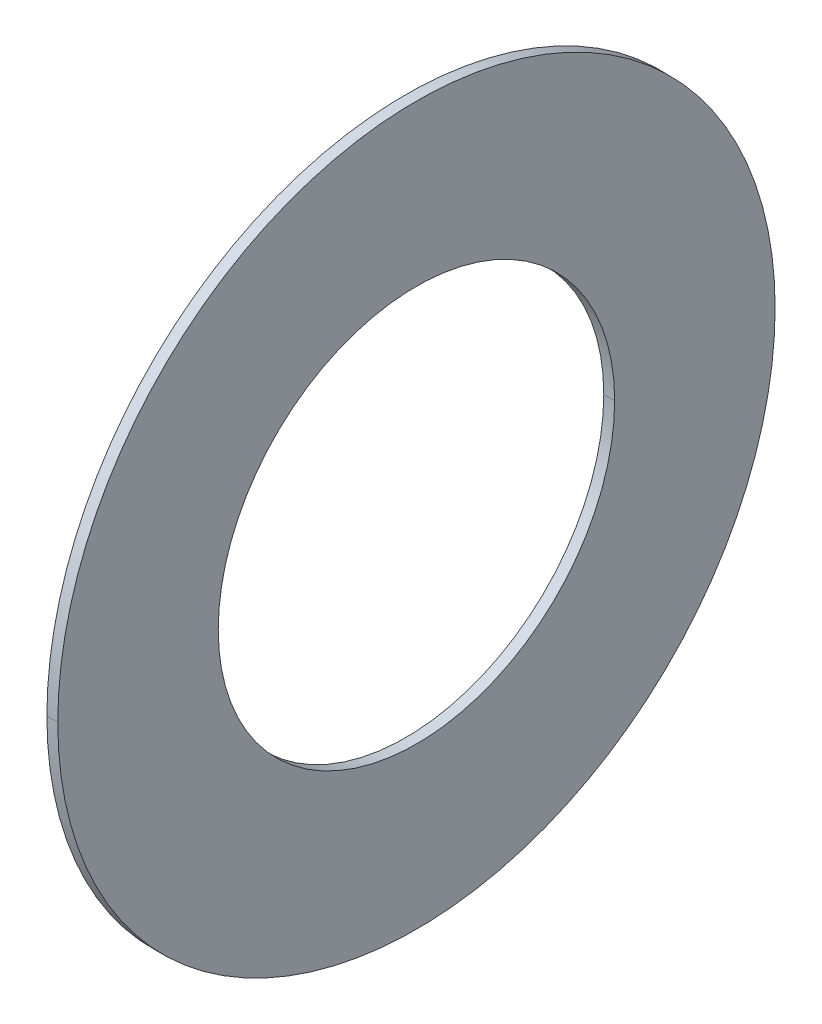
ISO-10303-21;
HEADER;
FILE_DESCRIPTION(('STEP AP214'),'2;1');
FILE_NAME('part.step','',(''),(''),'','','');
FILE_SCHEMA(('AUTOMOTIVE_DESIGN { 1 0 10303 214 1 1 1 1 }'));
ENDSEC;
DATA;
#1=APPLICATION_CONTEXT('core data for automotive mechanical design processes');
#2=APPLICATION_PROTOCOL_DEFINITION('international standard','automotive_design',2000,#1);
#3=PRODUCT_CONTEXT('',#1,'mechanical');
#4=PRODUCT('Part','Part','',(#3));
#5=PRODUCT_RELATED_PRODUCT_CATEGORY('part','',(#4));
#6=PRODUCT_DEFINITION_FORMATION('','',#4);
#7=PRODUCT_DEFINITION_CONTEXT('part definition',#1,'design');
#8=PRODUCT_DEFINITION('design','',#6,#7);
#9=PRODUCT_DEFINITION_SHAPE('','',#8);
#10=(LENGTH_UNIT() NAMED_UNIT(*) SI_UNIT(.MILLI.,.METRE.));
#11=(NAMED_UNIT(*) PLANE_ANGLE_UNIT() SI_UNIT($,.RADIAN.));
#12=(NAMED_UNIT(*) SI_UNIT($,.STERADIAN.) SOLID_ANGLE_UNIT());
#13=UNCERTAINTY_MEASURE_WITH_UNIT(LENGTH_MEASURE(1.E-05),#10,'distance_accuracy_value','');
#14=(GEOMETRIC_REPRESENTATION_CONTEXT(3) GLOBAL_UNCERTAINTY_ASSIGNED_CONTEXT((#13)) GLOBAL_UNIT_ASSIGNED_CONTEXT((#10,
#11,#12)) REPRESENTATION_CONTEXT('',''));
#15=CARTESIAN_POINT('',(0.,0.,0.));
#16=DIRECTION('',(0.,0.,1.));
#17=DIRECTION('',(1.,0.,0.));
#18=AXIS2_PLACEMENT_3D('',#15,#16,#17);
#19=CARTESIAN_POINT('',(6.615,9.5,0.));
#20=DIRECTION('',(-1.,0.,0.));
#21=DIRECTION('',(0.,0.,1.));
#22=AXIS2_PLACEMENT_3D('',#19,#20,#21);
#23=PLANE('',#22);
#24=CARTESIAN_POINT('',(6.615,0.,0.));
#25=DIRECTION('',(1.,0.,0.));
#26=DIRECTION('',(0.,0.,-1.));
#27=AXIS2_PLACEMENT_3D('',#24,#25,#26);
#28=CIRCLE('',#27,5.25);
#29=CARTESIAN_POINT('',(6.615,0.,-5.25));
#30=VERTEX_POINT('',#29);
#31=CARTESIAN_POINT('',(6.615,0.,5.25));
#32=VERTEX_POINT('',#31);
#33=EDGE_CURVE('E11',#30,#32,#28,.T.);
#34=ORIENTED_EDGE('',*,*,#33,.T.);
#35=CARTESIAN_POINT('',(6.615,0.,0.));
#36=DIRECTION('',(1.,0.,0.));
#37=DIRECTION('',(0.,0.,-1.));
#38=AXIS2_PLACEMENT_3D('',#35,#36,#37);
#39=CIRCLE('',#38,5.25);
#40=EDGE_CURVE('E25',#32,#30,#39,.T.);
#41=ORIENTED_EDGE('',*,*,#40,.T.);
#42=EDGE_LOOP('',(#34,#41));
#43=FACE_BOUND('',#42,.T.);
#44=CARTESIAN_POINT('',(6.615,0.,0.));
#45=DIRECTION('',(1.,0.,0.));
#46=DIRECTION('',(0.,0.,-1.));
#47=AXIS2_PLACEMENT_3D('',#44,#45,#46);
#48=CIRCLE('',#47,9.5);
#49=CARTESIAN_POINT('',(6.615,0.,9.5));
#50=VERTEX_POINT('',#49);
#51=CARTESIAN_POINT('',(6.615,0.,-9.5));
#52=VERTEX_POINT('',#51);
#53=EDGE_CURVE('E95',#50,#52,#48,.T.);
#54=ORIENTED_EDGE('',*,*,#53,.F.);
#55=CARTESIAN_POINT('',(6.615,0.,0.));
#56=DIRECTION('',(1.,0.,0.));
#57=DIRECTION('',(0.,0.,-1.));
#58=AXIS2_PLACEMENT_3D('',#55,#56,#57);
#59=CIRCLE('',#58,9.5);
#60=EDGE_CURVE('E90',#52,#50,#59,.T.);
#61=ORIENTED_EDGE('',*,*,#60,.F.);
#62=EDGE_LOOP('',(#54,#61));
#63=FACE_BOUND('',#62,.T.);
#64=ADVANCED_FACE('F17',(#43,#63),#23,.T.);
#65=CARTESIAN_POINT('',(6.90375,0.,0.));
#66=DIRECTION('',(1.,0.,0.));
#67=DIRECTION('',(0.,-1.,0.));
#68=AXIS2_PLACEMENT_3D('',#65,#66,#67);
#69=CYLINDRICAL_SURFACE('',#68,9.5);
#70=DIRECTION('',(1.,0.,0.));
#71=VECTOR('',#70,1.);
#72=CARTESIAN_POINT('',(6.615,0.,9.5));
#73=LINE('',#72,#71);
#74=CARTESIAN_POINT('',(6.90375,0.,9.5));
#75=VERTEX_POINT('',#74);
#76=EDGE_CURVE('E86',#50,#75,#73,.T.);
#77=ORIENTED_EDGE('',*,*,#76,.T.);
#78=CARTESIAN_POINT('',(6.90375,0.,0.));
#79=DIRECTION('',(1.,0.,0.));
#80=DIRECTION('',(0.,0.,-1.));
#81=AXIS2_PLACEMENT_3D('',#78,#79,#80);
#82=CIRCLE('',#81,9.5);
#83=CARTESIAN_POINT('',(6.90375,0.,-9.5));
#84=VERTEX_POINT('',#83);
#85=EDGE_CURVE('E81',#84,#75,#82,.T.);
#86=ORIENTED_EDGE('',*,*,#85,.F.);
#87=DIRECTION('',(1.,0.,0.));
#88=VECTOR('',#87,1.);
#89=CARTESIAN_POINT('',(6.615,0.,-9.5));
#90=LINE('',#89,#88);
#91=EDGE_CURVE('E70',#52,#84,#90,.T.);
#92=ORIENTED_EDGE('',*,*,#91,.F.);
#93=ORIENTED_EDGE('',*,*,#60,.T.);
#94=EDGE_LOOP('',(#77,#86,#92,#93));
#95=FACE_BOUND('',#94,.T.);
#96=ADVANCED_FACE('F111',(#95),#69,.T.);
#97=CARTESIAN_POINT('',(6.90375,0.,0.));
#98=DIRECTION('',(1.,0.,0.));
#99=DIRECTION('',(0.,1.,0.));
#100=AXIS2_PLACEMENT_3D('',#97,#98,#99);
#101=CYLINDRICAL_SURFACE('',#100,9.5);
#102=ORIENTED_EDGE('',*,*,#76,.F.);
#103=ORIENTED_EDGE('',*,*,#53,.T.);
#104=ORIENTED_EDGE('',*,*,#91,.T.);
#105=CARTESIAN_POINT('',(6.90375,0.,0.));
#106=DIRECTION('',(1.,0.,0.));
#107=DIRECTION('',(0.,0.,-1.));
#108=AXIS2_PLACEMENT_3D('',#105,#106,#107);
#109=CIRCLE('',#108,9.5);
#110=EDGE_CURVE('E67',#75,#84,#109,.T.);
#111=ORIENTED_EDGE('',*,*,#110,.F.);
#112=EDGE_LOOP('',(#102,#103,#104,#111));
#113=FACE_BOUND('',#112,.T.);
#114=ADVANCED_FACE('F106',(#113),#101,.T.);
#115=CARTESIAN_POINT('',(6.90375,5.25,0.));
#116=DIRECTION('',(1.,0.,0.));
#117=DIRECTION('',(0.,0.,-1.));
#118=AXIS2_PLACEMENT_3D('',#115,#116,#117);
#119=PLANE('',#118);
#120=ORIENTED_EDGE('',*,*,#85,.T.);
#121=ORIENTED_EDGE('',*,*,#110,.T.);
#122=EDGE_LOOP('',(#120,#121));
#123=FACE_BOUND('',#122,.T.);
#124=CARTESIAN_POINT('',(6.90375,0.,0.));
#125=DIRECTION('',(1.,0.,0.));
#126=DIRECTION('',(0.,0.,-1.));
#127=AXIS2_PLACEMENT_3D('',#124,#125,#126);
#128=CIRCLE('',#127,5.25);
#129=CARTESIAN_POINT('',(6.90375,0.,5.25));
#130=VERTEX_POINT('',#129);
#131=CARTESIAN_POINT('',(6.90375,0.,-5.25));
#132=VERTEX_POINT('',#131);
#133=EDGE_CURVE('E55',#130,#132,#128,.T.);
#134=ORIENTED_EDGE('',*,*,#133,.F.);
#135=CARTESIAN_POINT('',(6.90375,0.,0.));
#136=DIRECTION('',(1.,0.,0.));
#137=DIRECTION('',(0.,0.,-1.));
#138=AXIS2_PLACEMENT_3D('',#135,#136,#137);
#139=CIRCLE('',#138,5.25);
#140=EDGE_CURVE('E51',#132,#130,#139,.T.);
#141=ORIENTED_EDGE('',*,*,#140,.F.);
#142=EDGE_LOOP('',(#134,#141));
#143=FACE_BOUND('',#142,.T.);
#144=ADVANCED_FACE('F53',(#123,#143),#119,.T.);
#145=CARTESIAN_POINT('',(6.90375,0.,0.));
#146=DIRECTION('',(1.,0.,0.));
#147=DIRECTION('',(0.,-1.,0.));
#148=AXIS2_PLACEMENT_3D('',#145,#146,#147);
#149=CYLINDRICAL_SURFACE('',#148,5.25);
#150=DIRECTION('',(1.,0.,0.));
#151=VECTOR('',#150,1.);
#152=CARTESIAN_POINT('',(6.615,0.,5.25));
#153=LINE('',#152,#151);
#154=EDGE_CURVE('E59',#32,#130,#153,.T.);
#155=ORIENTED_EDGE('',*,*,#154,.F.);
#156=ORIENTED_EDGE('',*,*,#33,.F.);
#157=DIRECTION('',(1.,0.,0.));
#158=VECTOR('',#157,1.);
#159=CARTESIAN_POINT('',(6.615,0.,-5.25));
#160=LINE('',#159,#158);
#161=EDGE_CURVE('E62',#30,#132,#160,.T.);
#162=ORIENTED_EDGE('',*,*,#161,.T.);
#163=ORIENTED_EDGE('',*,*,#140,.T.);
#164=EDGE_LOOP('',(#155,#156,#162,#163));
#165=FACE_BOUND('',#164,.T.);
#166=ADVANCED_FACE('F63',(#165),#149,.F.);
#167=CARTESIAN_POINT('',(6.90375,0.,0.));
#168=DIRECTION('',(1.,0.,0.));
#169=DIRECTION('',(0.,1.,0.));
#170=AXIS2_PLACEMENT_3D('',#167,#168,#169);
#171=CYLINDRICAL_SURFACE('',#170,5.25);
#172=ORIENTED_EDGE('',*,*,#154,.T.);
#173=ORIENTED_EDGE('',*,*,#133,.T.);
#174=ORIENTED_EDGE('',*,*,#161,.F.);
#175=ORIENTED_EDGE('',*,*,#40,.F.);
#176=EDGE_LOOP('',(#172,#173,#174,#175));
#177=FACE_BOUND('',#176,.T.);
#178=ADVANCED_FACE('F66',(#177),#171,.F.);
#179=CLOSED_SHELL('',(#64,#96,#114,#144,#166,#178));
#180=MANIFOLD_SOLID_BREP('B1',#179);
#181=ADVANCED_BREP_SHAPE_REPRESENTATION('',(#18,#180),#14);
#182=SHAPE_DEFINITION_REPRESENTATION(#9,#181);
ENDSEC;
END-ISO-10303-21;
